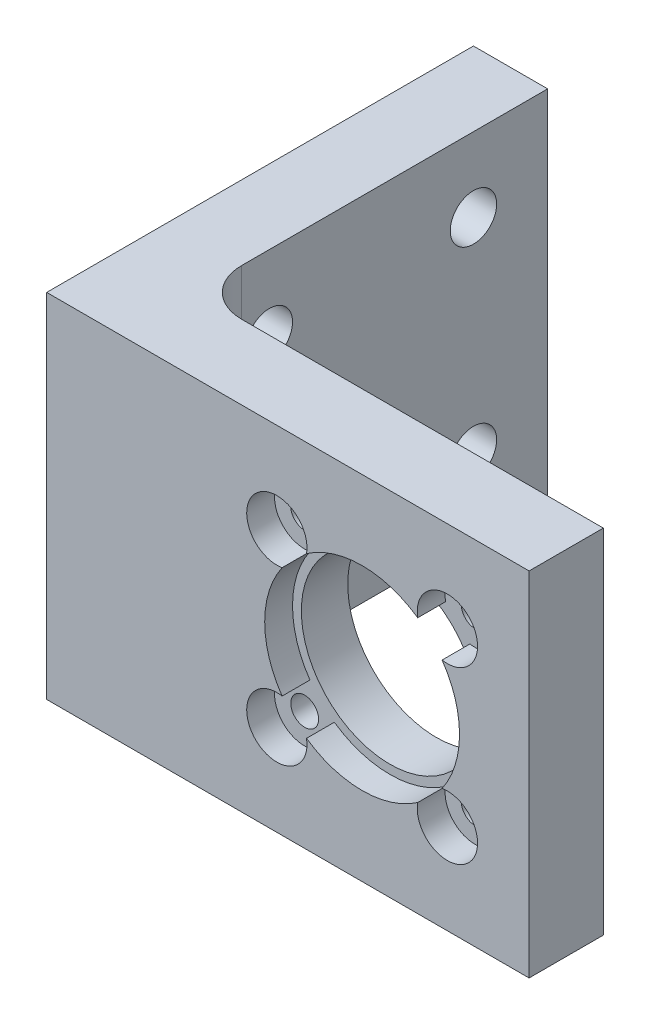
ISO-10303-21;
HEADER;
FILE_DESCRIPTION(('STEP AP214'),'2;1');
FILE_NAME('part.step','',(''),(''),'','','');
FILE_SCHEMA(('AUTOMOTIVE_DESIGN { 1 0 10303 214 1 1 1 1 }'));
ENDSEC;
DATA;
#1=APPLICATION_CONTEXT('core data for automotive mechanical design processes');
#2=APPLICATION_PROTOCOL_DEFINITION('international standard','automotive_design',2000,#1);
#3=PRODUCT_CONTEXT('',#1,'mechanical');
#4=PRODUCT('Part','Part','',(#3));
#5=PRODUCT_RELATED_PRODUCT_CATEGORY('part','',(#4));
#6=PRODUCT_DEFINITION_FORMATION('','',#4);
#7=PRODUCT_DEFINITION_CONTEXT('part definition',#1,'design');
#8=PRODUCT_DEFINITION('design','',#6,#7);
#9=PRODUCT_DEFINITION_SHAPE('','',#8);
#10=(LENGTH_UNIT() NAMED_UNIT(*) SI_UNIT(.MILLI.,.METRE.));
#11=(NAMED_UNIT(*) PLANE_ANGLE_UNIT() SI_UNIT($,.RADIAN.));
#12=(NAMED_UNIT(*) SI_UNIT($,.STERADIAN.) SOLID_ANGLE_UNIT());
#13=UNCERTAINTY_MEASURE_WITH_UNIT(LENGTH_MEASURE(1.E-05),#10,'distance_accuracy_value','');
#14=(GEOMETRIC_REPRESENTATION_CONTEXT(3) GLOBAL_UNCERTAINTY_ASSIGNED_CONTEXT((#13)) GLOBAL_UNIT_ASSIGNED_CONTEXT((#10,
#11,#12)) REPRESENTATION_CONTEXT('',''));
#15=CARTESIAN_POINT('',(0.,0.,0.));
#16=DIRECTION('',(0.,0.,1.));
#17=DIRECTION('',(1.,0.,0.));
#18=AXIS2_PLACEMENT_3D('',#15,#16,#17);
#19=CARTESIAN_POINT('',(0.,0.,5.));
#20=DIRECTION('',(0.,0.,-1.));
#21=DIRECTION('',(-1.,0.,0.));
#22=AXIS2_PLACEMENT_3D('',#19,#20,#21);
#23=PLANE('',#22);
#24=CARTESIAN_POINT('',(24.8076118445749,28.1923881554251,5.));
#25=DIRECTION('',(0.,0.,1.));
#26=DIRECTION('',(-1.,0.,0.));
#27=AXIS2_PLACEMENT_3D('',#24,#25,#26);
#28=CIRCLE('',#27,1.5);
#29=CARTESIAN_POINT('',(23.3076118445749,28.1923881554251,5.));
#30=VERTEX_POINT('',#29);
#31=EDGE_CURVE('E242',#30,#30,#28,.T.);
#32=ORIENTED_EDGE('',*,*,#31,.F.);
#33=EDGE_LOOP('',(#32));
#34=FACE_BOUND('',#33,.T.);
#35=CARTESIAN_POINT('',(24.8076118445749,9.80761184457487,5.));
#36=DIRECTION('',(0.,0.,1.));
#37=DIRECTION('',(1.,0.,0.));
#38=AXIS2_PLACEMENT_3D('',#35,#36,#37);
#39=CIRCLE('',#38,1.5);
#40=CARTESIAN_POINT('',(26.3076118445749,9.80761184457487,5.));
#41=VERTEX_POINT('',#40);
#42=EDGE_CURVE('E248',#41,#41,#39,.T.);
#43=ORIENTED_EDGE('',*,*,#42,.F.);
#44=EDGE_LOOP('',(#43));
#45=FACE_BOUND('',#44,.T.);
#46=CARTESIAN_POINT('',(43.1923881554251,9.80761184457487,5.));
#47=DIRECTION('',(0.,0.,1.));
#48=DIRECTION('',(-1.,0.,0.));
#49=AXIS2_PLACEMENT_3D('',#46,#47,#48);
#50=CIRCLE('',#49,1.5);
#51=CARTESIAN_POINT('',(41.6923881554251,9.80761184457487,5.));
#52=VERTEX_POINT('',#51);
#53=EDGE_CURVE('E254',#52,#52,#50,.T.);
#54=ORIENTED_EDGE('',*,*,#53,.F.);
#55=EDGE_LOOP('',(#54));
#56=FACE_BOUND('',#55,.T.);
#57=CARTESIAN_POINT('',(43.1923881554251,28.1923881554251,5.));
#58=DIRECTION('',(0.,0.,1.));
#59=DIRECTION('',(1.,0.,0.));
#60=AXIS2_PLACEMENT_3D('',#57,#58,#59);
#61=CIRCLE('',#60,1.50000000000001);
#62=CARTESIAN_POINT('',(44.6923881554251,28.1923881554251,5.));
#63=VERTEX_POINT('',#62);
#64=EDGE_CURVE('E260',#63,#63,#61,.T.);
#65=ORIENTED_EDGE('',*,*,#64,.F.);
#66=EDGE_LOOP('',(#65));
#67=FACE_BOUND('',#66,.T.);
#68=CARTESIAN_POINT('',(34.,19.,5.));
#69=DIRECTION('',(0.,0.,1.));
#70=DIRECTION('',(1.,0.,0.));
#71=AXIS2_PLACEMENT_3D('',#68,#69,#70);
#72=CIRCLE('',#71,9.55000000000001);
#73=CARTESIAN_POINT('',(43.55,19.,5.));
#74=VERTEX_POINT('',#73);
#75=EDGE_CURVE('E266',#74,#74,#72,.T.);
#76=ORIENTED_EDGE('',*,*,#75,.F.);
#77=EDGE_LOOP('',(#76));
#78=FACE_BOUND('',#77,.T.);
#79=CARTESIAN_POINT('',(24.8076118445749,9.80761184457488,5.));
#80=DIRECTION('',(0.,0.,1.));
#81=DIRECTION('',(1.,0.,0.));
#82=AXIS2_PLACEMENT_3D('',#79,#80,#81);
#83=CIRCLE('',#82,3.25000000000001);
#84=CARTESIAN_POINT('',(25.3781935279909,13.0071331435429,5.));
#85=VERTEX_POINT('',#84);
#86=CARTESIAN_POINT('',(28.0071331435429,10.3781935279909,5.));
#87=VERTEX_POINT('',#86);
#88=EDGE_CURVE('E151',#85,#87,#83,.T.);
#89=ORIENTED_EDGE('',*,*,#88,.T.);
#90=CARTESIAN_POINT('',(34.,19.,5.));
#91=DIRECTION('',(0.,0.,1.));
#92=DIRECTION('',(1.,0.,0.));
#93=AXIS2_PLACEMENT_3D('',#90,#91,#92);
#94=CIRCLE('',#93,10.5);
#95=CARTESIAN_POINT('',(39.992866856457,10.3781935279909,5.));
#96=VERTEX_POINT('',#95);
#97=EDGE_CURVE('E180',#87,#96,#94,.T.);
#98=ORIENTED_EDGE('',*,*,#97,.T.);
#99=CARTESIAN_POINT('',(43.1923881554251,9.80761184457488,5.));
#100=DIRECTION('',(0.,0.,1.));
#101=DIRECTION('',(-1.,0.,0.));
#102=AXIS2_PLACEMENT_3D('',#99,#100,#101);
#103=CIRCLE('',#102,3.25);
#104=CARTESIAN_POINT('',(42.6218064720091,13.0071331435429,5.));
#105=VERTEX_POINT('',#104);
#106=EDGE_CURVE('E157',#96,#105,#103,.T.);
#107=ORIENTED_EDGE('',*,*,#106,.T.);
#108=CARTESIAN_POINT('',(34.,19.,5.));
#109=DIRECTION('',(0.,0.,1.));
#110=DIRECTION('',(1.,0.,0.));
#111=AXIS2_PLACEMENT_3D('',#108,#109,#110);
#112=CIRCLE('',#111,10.5);
#113=CARTESIAN_POINT('',(42.6218064720091,24.9928668564571,5.));
#114=VERTEX_POINT('',#113);
#115=EDGE_CURVE('E184',#105,#114,#112,.T.);
#116=ORIENTED_EDGE('',*,*,#115,.T.);
#117=CARTESIAN_POINT('',(43.1923881554251,28.1923881554251,5.));
#118=DIRECTION('',(0.,0.,1.));
#119=DIRECTION('',(1.,0.,0.));
#120=AXIS2_PLACEMENT_3D('',#117,#118,#119);
#121=CIRCLE('',#120,3.25);
#122=CARTESIAN_POINT('',(39.992866856457,27.6218064720091,5.));
#123=VERTEX_POINT('',#122);
#124=EDGE_CURVE('E187',#114,#123,#121,.T.);
#125=ORIENTED_EDGE('',*,*,#124,.T.);
#126=CARTESIAN_POINT('',(34.,19.,5.));
#127=DIRECTION('',(0.,0.,1.));
#128=DIRECTION('',(1.,0.,0.));
#129=AXIS2_PLACEMENT_3D('',#126,#127,#128);
#130=CIRCLE('',#129,10.5);
#131=CARTESIAN_POINT('',(28.0071331435429,27.6218064720091,5.));
#132=VERTEX_POINT('',#131);
#133=EDGE_CURVE('E190',#123,#132,#130,.T.);
#134=ORIENTED_EDGE('',*,*,#133,.T.);
#135=CARTESIAN_POINT('',(24.8076118445749,28.1923881554251,5.));
#136=DIRECTION('',(0.,0.,1.));
#137=DIRECTION('',(-1.,0.,0.));
#138=AXIS2_PLACEMENT_3D('',#135,#136,#137);
#139=CIRCLE('',#138,3.25000000000001);
#140=CARTESIAN_POINT('',(25.3781935279909,24.9928668564571,5.));
#141=VERTEX_POINT('',#140);
#142=EDGE_CURVE('E193',#132,#141,#139,.T.);
#143=ORIENTED_EDGE('',*,*,#142,.T.);
#144=CARTESIAN_POINT('',(34.,19.,5.));
#145=DIRECTION('',(0.,0.,1.));
#146=DIRECTION('',(1.,0.,0.));
#147=AXIS2_PLACEMENT_3D('',#144,#145,#146);
#148=CIRCLE('',#147,10.5);
#149=EDGE_CURVE('E196',#141,#85,#148,.T.);
#150=ORIENTED_EDGE('',*,*,#149,.T.);
#151=EDGE_LOOP('',(#89,#98,#107,#116,#125,#134,#143,#150));
#152=FACE_BOUND('',#151,.T.);
#153=ADVANCED_FACE('F35',(#34,#45,#56,#67,#78,#152),#23,.F.);
#154=CARTESIAN_POINT('',(13.,0.,-5.));
#155=DIRECTION('',(0.,1.,0.));
#156=DIRECTION('',(-1.,0.,0.));
#157=AXIS2_PLACEMENT_3D('',#154,#155,#156);
#158=CYLINDRICAL_SURFACE('',#157,5.);
#159=DIRECTION('',(0.,1.,0.));
#160=VECTOR('',#159,1.);
#161=CARTESIAN_POINT('',(13.,0.,0.));
#162=LINE('',#161,#160);
#163=CARTESIAN_POINT('',(13.,0.,0.));
#164=VERTEX_POINT('',#163);
#165=CARTESIAN_POINT('',(13.,38.,0.));
#166=VERTEX_POINT('',#165);
#167=EDGE_CURVE('E287',#164,#166,#162,.T.);
#168=ORIENTED_EDGE('',*,*,#167,.F.);
#169=CARTESIAN_POINT('',(13.,0.,-5.));
#170=DIRECTION('',(0.,1.,0.));
#171=DIRECTION('',(-1.,0.,0.));
#172=AXIS2_PLACEMENT_3D('',#169,#170,#171);
#173=CIRCLE('',#172,5.);
#174=CARTESIAN_POINT('',(7.99999999999999,0.,-5.));
#175=VERTEX_POINT('',#174);
#176=EDGE_CURVE('E43',#164,#175,#173,.F.);
#177=ORIENTED_EDGE('',*,*,#176,.T.);
#178=DIRECTION('',(0.,1.,0.));
#179=VECTOR('',#178,1.);
#180=CARTESIAN_POINT('',(7.99999999999999,0.,-5.));
#181=LINE('',#180,#179);
#182=CARTESIAN_POINT('',(8.,38.,-5.));
#183=VERTEX_POINT('',#182);
#184=EDGE_CURVE('E290',#183,#175,#181,.F.);
#185=ORIENTED_EDGE('',*,*,#184,.F.);
#186=CARTESIAN_POINT('',(13.,38.,-5.));
#187=DIRECTION('',(0.,-1.,0.));
#188=DIRECTION('',(1.,0.,0.));
#189=AXIS2_PLACEMENT_3D('',#186,#187,#188);
#190=CIRCLE('',#189,5.);
#191=EDGE_CURVE('E11',#183,#166,#190,.F.);
#192=ORIENTED_EDGE('',*,*,#191,.T.);
#193=EDGE_LOOP('',(#168,#177,#185,#192));
#194=FACE_BOUND('',#193,.T.);
#195=ADVANCED_FACE('F37',(#194),#158,.F.);
#196=CARTESIAN_POINT('',(0.,0.,0.));
#197=DIRECTION('',(0.,0.,-1.));
#198=DIRECTION('',(-1.,0.,0.));
#199=AXIS2_PLACEMENT_3D('',#196,#197,#198);
#200=PLANE('',#199);
#201=DIRECTION('',(1.,0.,0.));
#202=VECTOR('',#201,1.);
#203=CARTESIAN_POINT('',(0.,0.,0.));
#204=LINE('',#203,#202);
#205=CARTESIAN_POINT('',(52.,0.,0.));
#206=VERTEX_POINT('',#205);
#207=EDGE_CURVE('E269',#164,#206,#204,.T.);
#208=ORIENTED_EDGE('',*,*,#207,.F.);
#209=ORIENTED_EDGE('',*,*,#167,.T.);
#210=DIRECTION('',(-1.,0.,0.));
#211=VECTOR('',#210,1.);
#212=CARTESIAN_POINT('',(0.,38.,0.));
#213=LINE('',#212,#211);
#214=CARTESIAN_POINT('',(52.,38.,0.));
#215=VERTEX_POINT('',#214);
#216=EDGE_CURVE('E275',#215,#166,#213,.T.);
#217=ORIENTED_EDGE('',*,*,#216,.F.);
#218=DIRECTION('',(0.,1.,0.));
#219=VECTOR('',#218,1.);
#220=CARTESIAN_POINT('',(52.,0.,0.));
#221=LINE('',#220,#219);
#222=EDGE_CURVE('E273',#206,#215,#221,.T.);
#223=ORIENTED_EDGE('',*,*,#222,.F.);
#224=EDGE_LOOP('',(#208,#209,#217,#223));
#225=FACE_BOUND('',#224,.T.);
#226=CARTESIAN_POINT('',(24.8076118445749,9.80761184457487,0.));
#227=DIRECTION('',(0.,0.,1.));
#228=DIRECTION('',(1.,0.,0.));
#229=AXIS2_PLACEMENT_3D('',#226,#227,#228);
#230=CIRCLE('',#229,1.5);
#231=CARTESIAN_POINT('',(26.3076118445749,9.80761184457487,0.));
#232=VERTEX_POINT('',#231);
#233=EDGE_CURVE('E245',#232,#232,#230,.T.);
#234=ORIENTED_EDGE('',*,*,#233,.T.);
#235=EDGE_LOOP('',(#234));
#236=FACE_BOUND('',#235,.T.);
#237=CARTESIAN_POINT('',(43.1923881554251,28.1923881554251,0.));
#238=DIRECTION('',(0.,0.,1.));
#239=DIRECTION('',(1.,0.,0.));
#240=AXIS2_PLACEMENT_3D('',#237,#238,#239);
#241=CIRCLE('',#240,1.50000000000001);
#242=CARTESIAN_POINT('',(44.6923881554251,28.1923881554251,0.));
#243=VERTEX_POINT('',#242);
#244=EDGE_CURVE('E257',#243,#243,#241,.T.);
#245=ORIENTED_EDGE('',*,*,#244,.T.);
#246=EDGE_LOOP('',(#245));
#247=FACE_BOUND('',#246,.T.);
#248=CARTESIAN_POINT('',(34.,19.,0.));
#249=DIRECTION('',(0.,0.,1.));
#250=DIRECTION('',(1.,0.,0.));
#251=AXIS2_PLACEMENT_3D('',#248,#249,#250);
#252=CIRCLE('',#251,9.55000000000001);
#253=CARTESIAN_POINT('',(43.55,19.,0.));
#254=VERTEX_POINT('',#253);
#255=EDGE_CURVE('E263',#254,#254,#252,.T.);
#256=ORIENTED_EDGE('',*,*,#255,.T.);
#257=EDGE_LOOP('',(#256));
#258=FACE_BOUND('',#257,.T.);
#259=CARTESIAN_POINT('',(43.1923881554251,9.80761184457487,0.));
#260=DIRECTION('',(0.,0.,1.));
#261=DIRECTION('',(-1.,0.,0.));
#262=AXIS2_PLACEMENT_3D('',#259,#260,#261);
#263=CIRCLE('',#262,1.5);
#264=CARTESIAN_POINT('',(41.6923881554251,9.80761184457487,0.));
#265=VERTEX_POINT('',#264);
#266=EDGE_CURVE('E251',#265,#265,#263,.T.);
#267=ORIENTED_EDGE('',*,*,#266,.T.);
#268=EDGE_LOOP('',(#267));
#269=FACE_BOUND('',#268,.T.);
#270=CARTESIAN_POINT('',(24.8076118445749,28.1923881554251,0.));
#271=DIRECTION('',(0.,0.,1.));
#272=DIRECTION('',(-1.,0.,0.));
#273=AXIS2_PLACEMENT_3D('',#270,#271,#272);
#274=CIRCLE('',#273,1.5);
#275=CARTESIAN_POINT('',(23.3076118445749,28.1923881554251,0.));
#276=VERTEX_POINT('',#275);
#277=EDGE_CURVE('E241',#276,#276,#274,.T.);
#278=ORIENTED_EDGE('',*,*,#277,.T.);
#279=EDGE_LOOP('',(#278));
#280=FACE_BOUND('',#279,.T.);
#281=ADVANCED_FACE('F318',(#225,#236,#247,#258,#269,#280),#200,.T.);
#282=CARTESIAN_POINT('',(0.,0.,5.));
#283=DIRECTION('',(1.,0.,0.));
#284=DIRECTION('',(0.,1.,0.));
#285=AXIS2_PLACEMENT_3D('',#282,#283,#284);
#286=PLANE('',#285);
#287=CARTESIAN_POINT('',(0.,30.,-30.));
#288=DIRECTION('',(-1.,0.,0.));
#289=DIRECTION('',(0.,1.,0.));
#290=AXIS2_PLACEMENT_3D('',#287,#288,#289);
#291=CIRCLE('',#290,2.5);
#292=CARTESIAN_POINT('',(0.,32.5,-30.));
#293=VERTEX_POINT('',#292);
#294=EDGE_CURVE('E370',#293,#293,#291,.T.);
#295=ORIENTED_EDGE('',*,*,#294,.F.);
#296=EDGE_LOOP('',(#295));
#297=FACE_BOUND('',#296,.T.);
#298=CARTESIAN_POINT('',(0.,7.99999999999999,-8.));
#299=DIRECTION('',(-1.,0.,0.));
#300=DIRECTION('',(0.,1.,0.));
#301=AXIS2_PLACEMENT_3D('',#298,#299,#300);
#302=CIRCLE('',#301,2.5);
#303=CARTESIAN_POINT('',(0.,10.5,-8.));
#304=VERTEX_POINT('',#303);
#305=EDGE_CURVE('E374',#304,#304,#302,.T.);
#306=ORIENTED_EDGE('',*,*,#305,.F.);
#307=EDGE_LOOP('',(#306));
#308=FACE_BOUND('',#307,.T.);
#309=CARTESIAN_POINT('',(0.,7.99999999999999,-30.));
#310=DIRECTION('',(-1.,0.,0.));
#311=DIRECTION('',(0.,-1.,0.));
#312=AXIS2_PLACEMENT_3D('',#309,#310,#311);
#313=CIRCLE('',#312,2.5);
#314=CARTESIAN_POINT('',(0.,5.49999999999999,-30.));
#315=VERTEX_POINT('',#314);
#316=EDGE_CURVE('E378',#315,#315,#313,.T.);
#317=ORIENTED_EDGE('',*,*,#316,.F.);
#318=EDGE_LOOP('',(#317));
#319=FACE_BOUND('',#318,.T.);
#320=CARTESIAN_POINT('',(0.,30.,-8.));
#321=DIRECTION('',(-1.,0.,0.));
#322=DIRECTION('',(0.,-1.,0.));
#323=AXIS2_PLACEMENT_3D('',#320,#321,#322);
#324=CIRCLE('',#323,2.5);
#325=CARTESIAN_POINT('',(0.,27.5,-8.));
#326=VERTEX_POINT('',#325);
#327=EDGE_CURVE('E381',#326,#326,#324,.T.);
#328=ORIENTED_EDGE('',*,*,#327,.F.);
#329=EDGE_LOOP('',(#328));
#330=FACE_BOUND('',#329,.T.);
#331=DIRECTION('',(0.,0.,-1.));
#332=VECTOR('',#331,1.);
#333=CARTESIAN_POINT('',(0.,38.,5.));
#334=LINE('',#333,#332);
#335=CARTESIAN_POINT('',(0.,38.,8.));
#336=VERTEX_POINT('',#335);
#337=CARTESIAN_POINT('',(0.,38.,-38.));
#338=VERTEX_POINT('',#337);
#339=EDGE_CURVE('E277',#336,#338,#334,.T.);
#340=ORIENTED_EDGE('',*,*,#339,.T.);
#341=DIRECTION('',(0.,1.,0.));
#342=VECTOR('',#341,1.);
#343=CARTESIAN_POINT('',(0.,0.,-38.));
#344=LINE('',#343,#342);
#345=CARTESIAN_POINT('',(0.,0.,-38.));
#346=VERTEX_POINT('',#345);
#347=EDGE_CURVE('E232',#346,#338,#344,.T.);
#348=ORIENTED_EDGE('',*,*,#347,.F.);
#349=DIRECTION('',(0.,0.,-1.));
#350=VECTOR('',#349,1.);
#351=CARTESIAN_POINT('',(0.,0.,5.));
#352=LINE('',#351,#350);
#353=CARTESIAN_POINT('',(0.,0.,8.));
#354=VERTEX_POINT('',#353);
#355=EDGE_CURVE('E285',#354,#346,#352,.T.);
#356=ORIENTED_EDGE('',*,*,#355,.F.);
#357=DIRECTION('',(0.,-1.,0.));
#358=VECTOR('',#357,1.);
#359=CARTESIAN_POINT('',(0.,38.,8.));
#360=LINE('',#359,#358);
#361=EDGE_CURVE('E158',#336,#354,#360,.T.);
#362=ORIENTED_EDGE('',*,*,#361,.F.);
#363=EDGE_LOOP('',(#340,#348,#356,#362));
#364=FACE_BOUND('',#363,.T.);
#365=ADVANCED_FACE('F307',(#297,#308,#319,#330,#364),#286,.F.);
#366=CARTESIAN_POINT('',(0.,0.,5.));
#367=DIRECTION('',(0.,1.,0.));
#368=DIRECTION('',(-1.,0.,0.));
#369=AXIS2_PLACEMENT_3D('',#366,#367,#368);
#370=PLANE('',#369);
#371=ORIENTED_EDGE('',*,*,#176,.F.);
#372=ORIENTED_EDGE('',*,*,#207,.T.);
#373=DIRECTION('',(0.,0.,-1.));
#374=VECTOR('',#373,1.);
#375=CARTESIAN_POINT('',(52.,0.,5.));
#376=LINE('',#375,#374);
#377=CARTESIAN_POINT('',(52.,0.,8.));
#378=VERTEX_POINT('',#377);
#379=EDGE_CURVE('E282',#378,#206,#376,.T.);
#380=ORIENTED_EDGE('',*,*,#379,.F.);
#381=DIRECTION('',(1.,0.,0.));
#382=VECTOR('',#381,1.);
#383=CARTESIAN_POINT('',(0.,0.,8.));
#384=LINE('',#383,#382);
#385=EDGE_CURVE('E215',#354,#378,#384,.T.);
#386=ORIENTED_EDGE('',*,*,#385,.F.);
#387=ORIENTED_EDGE('',*,*,#355,.T.);
#388=DIRECTION('',(-1.,0.,0.));
#389=VECTOR('',#388,1.);
#390=CARTESIAN_POINT('',(0.,0.,-38.));
#391=LINE('',#390,#389);
#392=CARTESIAN_POINT('',(7.99999999999999,0.,-38.));
#393=VERTEX_POINT('',#392);
#394=EDGE_CURVE('E229',#393,#346,#391,.T.);
#395=ORIENTED_EDGE('',*,*,#394,.F.);
#396=DIRECTION('',(0.,0.,1.));
#397=VECTOR('',#396,1.);
#398=CARTESIAN_POINT('',(7.99999999999999,0.,-38.));
#399=LINE('',#398,#397);
#400=EDGE_CURVE('E235',#393,#175,#399,.T.);
#401=ORIENTED_EDGE('',*,*,#400,.T.);
#402=EDGE_LOOP('',(#371,#372,#380,#386,#387,#395,#401));
#403=FACE_BOUND('',#402,.T.);
#404=ADVANCED_FACE('F300',(#403),#370,.F.);
#405=CARTESIAN_POINT('',(52.,0.,5.));
#406=DIRECTION('',(-1.,0.,0.));
#407=DIRECTION('',(0.,0.,1.));
#408=AXIS2_PLACEMENT_3D('',#405,#406,#407);
#409=PLANE('',#408);
#410=ORIENTED_EDGE('',*,*,#222,.T.);
#411=DIRECTION('',(0.,0.,-1.));
#412=VECTOR('',#411,1.);
#413=CARTESIAN_POINT('',(52.,38.,5.));
#414=LINE('',#413,#412);
#415=CARTESIAN_POINT('',(52.,38.,8.));
#416=VERTEX_POINT('',#415);
#417=EDGE_CURVE('E279',#416,#215,#414,.T.);
#418=ORIENTED_EDGE('',*,*,#417,.F.);
#419=DIRECTION('',(0.,1.,0.));
#420=VECTOR('',#419,1.);
#421=CARTESIAN_POINT('',(52.,38.,8.));
#422=LINE('',#421,#420);
#423=EDGE_CURVE('E218',#378,#416,#422,.T.);
#424=ORIENTED_EDGE('',*,*,#423,.F.);
#425=ORIENTED_EDGE('',*,*,#379,.T.);
#426=EDGE_LOOP('',(#410,#418,#424,#425));
#427=FACE_BOUND('',#426,.T.);
#428=ADVANCED_FACE('F314',(#427),#409,.F.);
#429=CARTESIAN_POINT('',(0.,38.,5.));
#430=DIRECTION('',(0.,-1.,0.));
#431=DIRECTION('',(1.,0.,0.));
#432=AXIS2_PLACEMENT_3D('',#429,#430,#431);
#433=PLANE('',#432);
#434=ORIENTED_EDGE('',*,*,#216,.T.);
#435=ORIENTED_EDGE('',*,*,#191,.F.);
#436=DIRECTION('',(0.,0.,1.));
#437=VECTOR('',#436,1.);
#438=CARTESIAN_POINT('',(8.,38.,-38.));
#439=LINE('',#438,#437);
#440=CARTESIAN_POINT('',(8.,38.,-38.));
#441=VERTEX_POINT('',#440);
#442=EDGE_CURVE('E238',#441,#183,#439,.T.);
#443=ORIENTED_EDGE('',*,*,#442,.F.);
#444=DIRECTION('',(1.,0.,0.));
#445=VECTOR('',#444,1.);
#446=CARTESIAN_POINT('',(0.,38.,-38.));
#447=LINE('',#446,#445);
#448=EDGE_CURVE('E224',#338,#441,#447,.T.);
#449=ORIENTED_EDGE('',*,*,#448,.F.);
#450=ORIENTED_EDGE('',*,*,#339,.F.);
#451=DIRECTION('',(-1.,0.,0.));
#452=VECTOR('',#451,1.);
#453=CARTESIAN_POINT('',(0.,38.,8.));
#454=LINE('',#453,#452);
#455=EDGE_CURVE('E221',#416,#336,#454,.T.);
#456=ORIENTED_EDGE('',*,*,#455,.F.);
#457=ORIENTED_EDGE('',*,*,#417,.T.);
#458=EDGE_LOOP('',(#434,#435,#443,#449,#450,#456,#457));
#459=FACE_BOUND('',#458,.T.);
#460=ADVANCED_FACE('F310',(#459),#433,.F.);
#461=CARTESIAN_POINT('',(34.,19.,5.));
#462=DIRECTION('',(0.,0.,-1.));
#463=DIRECTION('',(-1.,0.,0.));
#464=AXIS2_PLACEMENT_3D('',#461,#462,#463);
#465=CYLINDRICAL_SURFACE('',#464,9.55000000000001);
#466=ORIENTED_EDGE('',*,*,#75,.T.);
#467=EDGE_LOOP('',(#466));
#468=FACE_BOUND('',#467,.T.);
#469=ORIENTED_EDGE('',*,*,#255,.F.);
#470=EDGE_LOOP('',(#469));
#471=FACE_BOUND('',#470,.T.);
#472=ADVANCED_FACE('F355',(#468,#471),#465,.F.);
#473=CARTESIAN_POINT('',(43.1923881554251,28.1923881554251,5.));
#474=DIRECTION('',(0.,0.,-1.));
#475=DIRECTION('',(-1.,0.,0.));
#476=AXIS2_PLACEMENT_3D('',#473,#474,#475);
#477=CYLINDRICAL_SURFACE('',#476,1.50000000000001);
#478=ORIENTED_EDGE('',*,*,#64,.T.);
#479=EDGE_LOOP('',(#478));
#480=FACE_BOUND('',#479,.T.);
#481=ORIENTED_EDGE('',*,*,#244,.F.);
#482=EDGE_LOOP('',(#481));
#483=FACE_BOUND('',#482,.T.);
#484=ADVANCED_FACE('F585',(#480,#483),#477,.F.);
#485=CARTESIAN_POINT('',(43.1923881554251,9.80761184457487,5.));
#486=DIRECTION('',(0.,0.,-1.));
#487=DIRECTION('',(-1.,0.,0.));
#488=AXIS2_PLACEMENT_3D('',#485,#486,#487);
#489=CYLINDRICAL_SURFACE('',#488,1.5);
#490=ORIENTED_EDGE('',*,*,#53,.T.);
#491=EDGE_LOOP('',(#490));
#492=FACE_BOUND('',#491,.T.);
#493=ORIENTED_EDGE('',*,*,#266,.F.);
#494=EDGE_LOOP('',(#493));
#495=FACE_BOUND('',#494,.T.);
#496=ADVANCED_FACE('F343',(#492,#495),#489,.F.);
#497=CARTESIAN_POINT('',(24.8076118445749,9.80761184457487,5.));
#498=DIRECTION('',(0.,0.,-1.));
#499=DIRECTION('',(-1.,0.,0.));
#500=AXIS2_PLACEMENT_3D('',#497,#498,#499);
#501=CYLINDRICAL_SURFACE('',#500,1.5);
#502=ORIENTED_EDGE('',*,*,#42,.T.);
#503=EDGE_LOOP('',(#502));
#504=FACE_BOUND('',#503,.T.);
#505=ORIENTED_EDGE('',*,*,#233,.F.);
#506=EDGE_LOOP('',(#505));
#507=FACE_BOUND('',#506,.T.);
#508=ADVANCED_FACE('F334',(#504,#507),#501,.F.);
#509=CARTESIAN_POINT('',(24.8076118445749,28.1923881554251,5.));
#510=DIRECTION('',(0.,0.,-1.));
#511=DIRECTION('',(-1.,0.,0.));
#512=AXIS2_PLACEMENT_3D('',#509,#510,#511);
#513=CYLINDRICAL_SURFACE('',#512,1.5);
#514=ORIENTED_EDGE('',*,*,#31,.T.);
#515=EDGE_LOOP('',(#514));
#516=FACE_BOUND('',#515,.T.);
#517=ORIENTED_EDGE('',*,*,#277,.F.);
#518=EDGE_LOOP('',(#517));
#519=FACE_BOUND('',#518,.T.);
#520=ADVANCED_FACE('F332',(#516,#519),#513,.F.);
#521=CARTESIAN_POINT('',(7.99999999999999,0.,-38.));
#522=DIRECTION('',(-1.,0.,0.));
#523=DIRECTION('',(0.,-1.,0.));
#524=AXIS2_PLACEMENT_3D('',#521,#522,#523);
#525=PLANE('',#524);
#526=CARTESIAN_POINT('',(7.99999999999999,30.,-30.));
#527=DIRECTION('',(-1.,0.,0.));
#528=DIRECTION('',(0.,1.,0.));
#529=AXIS2_PLACEMENT_3D('',#526,#527,#528);
#530=CIRCLE('',#529,2.5);
#531=CARTESIAN_POINT('',(7.99999999999999,32.5,-30.));
#532=VERTEX_POINT('',#531);
#533=EDGE_CURVE('E383',#532,#532,#530,.T.);
#534=ORIENTED_EDGE('',*,*,#533,.T.);
#535=EDGE_LOOP('',(#534));
#536=FACE_BOUND('',#535,.T.);
#537=CARTESIAN_POINT('',(8.,7.99999999999999,-8.));
#538=DIRECTION('',(-1.,0.,0.));
#539=DIRECTION('',(0.,1.,0.));
#540=AXIS2_PLACEMENT_3D('',#537,#538,#539);
#541=CIRCLE('',#540,2.5);
#542=CARTESIAN_POINT('',(8.,10.5,-8.));
#543=VERTEX_POINT('',#542);
#544=EDGE_CURVE('E390',#543,#543,#541,.T.);
#545=ORIENTED_EDGE('',*,*,#544,.T.);
#546=EDGE_LOOP('',(#545));
#547=FACE_BOUND('',#546,.T.);
#548=CARTESIAN_POINT('',(8.,7.99999999999999,-30.));
#549=DIRECTION('',(-1.,0.,0.));
#550=DIRECTION('',(0.,-1.,0.));
#551=AXIS2_PLACEMENT_3D('',#548,#549,#550);
#552=CIRCLE('',#551,2.5);
#553=CARTESIAN_POINT('',(8.,5.49999999999999,-30.));
#554=VERTEX_POINT('',#553);
#555=EDGE_CURVE('E391',#554,#554,#552,.T.);
#556=ORIENTED_EDGE('',*,*,#555,.T.);
#557=EDGE_LOOP('',(#556));
#558=FACE_BOUND('',#557,.T.);
#559=CARTESIAN_POINT('',(7.99999999999999,30.,-8.));
#560=DIRECTION('',(-1.,0.,0.));
#561=DIRECTION('',(0.,-1.,0.));
#562=AXIS2_PLACEMENT_3D('',#559,#560,#561);
#563=CIRCLE('',#562,2.5);
#564=CARTESIAN_POINT('',(7.99999999999999,27.5,-8.));
#565=VERTEX_POINT('',#564);
#566=EDGE_CURVE('E182',#565,#565,#563,.T.);
#567=ORIENTED_EDGE('',*,*,#566,.T.);
#568=EDGE_LOOP('',(#567));
#569=FACE_BOUND('',#568,.T.);
#570=ORIENTED_EDGE('',*,*,#442,.T.);
#571=ORIENTED_EDGE('',*,*,#184,.T.);
#572=ORIENTED_EDGE('',*,*,#400,.F.);
#573=DIRECTION('',(0.,-1.,0.));
#574=VECTOR('',#573,1.);
#575=CARTESIAN_POINT('',(7.99999999999999,0.,-38.));
#576=LINE('',#575,#574);
#577=EDGE_CURVE('E227',#441,#393,#576,.T.);
#578=ORIENTED_EDGE('',*,*,#577,.F.);
#579=EDGE_LOOP('',(#570,#571,#572,#578));
#580=FACE_BOUND('',#579,.T.);
#581=ADVANCED_FACE('F298',(#536,#547,#558,#569,#580),#525,.F.);
#582=CARTESIAN_POINT('',(0.,0.,-38.));
#583=DIRECTION('',(0.,0.,-1.));
#584=DIRECTION('',(-1.,0.,0.));
#585=AXIS2_PLACEMENT_3D('',#582,#583,#584);
#586=PLANE('',#585);
#587=ORIENTED_EDGE('',*,*,#448,.T.);
#588=ORIENTED_EDGE('',*,*,#577,.T.);
#589=ORIENTED_EDGE('',*,*,#394,.T.);
#590=ORIENTED_EDGE('',*,*,#347,.T.);
#591=EDGE_LOOP('',(#587,#588,#589,#590));
#592=FACE_BOUND('',#591,.T.);
#593=ADVANCED_FACE('F304',(#592),#586,.T.);
#594=CARTESIAN_POINT('',(0.,0.,8.));
#595=DIRECTION('',(0.,0.,1.));
#596=DIRECTION('',(1.,0.,0.));
#597=AXIS2_PLACEMENT_3D('',#594,#595,#596);
#598=PLANE('',#597);
#599=ORIENTED_EDGE('',*,*,#361,.T.);
#600=ORIENTED_EDGE('',*,*,#385,.T.);
#601=ORIENTED_EDGE('',*,*,#423,.T.);
#602=ORIENTED_EDGE('',*,*,#455,.T.);
#603=EDGE_LOOP('',(#599,#600,#601,#602));
#604=FACE_BOUND('',#603,.T.);
#605=CARTESIAN_POINT('',(43.1923881554251,9.80761184457488,8.));
#606=DIRECTION('',(0.,0.,1.));
#607=DIRECTION('',(-1.,0.,0.));
#608=AXIS2_PLACEMENT_3D('',#605,#606,#607);
#609=CIRCLE('',#608,3.25);
#610=CARTESIAN_POINT('',(39.992866856457,10.3781935279909,8.));
#611=VERTEX_POINT('',#610);
#612=CARTESIAN_POINT('',(42.6218064720091,13.0071331435429,8.));
#613=VERTEX_POINT('',#612);
#614=EDGE_CURVE('E150',#611,#613,#609,.T.);
#615=ORIENTED_EDGE('',*,*,#614,.F.);
#616=CARTESIAN_POINT('',(34.,19.,8.));
#617=DIRECTION('',(0.,0.,1.));
#618=DIRECTION('',(1.,0.,0.));
#619=AXIS2_PLACEMENT_3D('',#616,#617,#618);
#620=CIRCLE('',#619,10.5);
#621=CARTESIAN_POINT('',(28.0071331435429,10.3781935279909,8.));
#622=VERTEX_POINT('',#621);
#623=EDGE_CURVE('E142',#622,#611,#620,.T.);
#624=ORIENTED_EDGE('',*,*,#623,.F.);
#625=CARTESIAN_POINT('',(24.8076118445749,9.80761184457488,8.));
#626=DIRECTION('',(0.,0.,1.));
#627=DIRECTION('',(1.,0.,0.));
#628=AXIS2_PLACEMENT_3D('',#625,#626,#627);
#629=CIRCLE('',#628,3.25000000000001);
#630=CARTESIAN_POINT('',(25.3781935279909,13.0071331435429,8.));
#631=VERTEX_POINT('',#630);
#632=EDGE_CURVE('E178',#631,#622,#629,.T.);
#633=ORIENTED_EDGE('',*,*,#632,.F.);
#634=CARTESIAN_POINT('',(34.,19.,8.));
#635=DIRECTION('',(0.,0.,1.));
#636=DIRECTION('',(1.,0.,0.));
#637=AXIS2_PLACEMENT_3D('',#634,#635,#636);
#638=CIRCLE('',#637,10.5);
#639=CARTESIAN_POINT('',(25.3781935279909,24.9928668564571,8.));
#640=VERTEX_POINT('',#639);
#641=EDGE_CURVE('E175',#640,#631,#638,.T.);
#642=ORIENTED_EDGE('',*,*,#641,.F.);
#643=CARTESIAN_POINT('',(24.8076118445749,28.1923881554251,8.));
#644=DIRECTION('',(0.,0.,1.));
#645=DIRECTION('',(-1.,0.,0.));
#646=AXIS2_PLACEMENT_3D('',#643,#644,#645);
#647=CIRCLE('',#646,3.25000000000001);
#648=CARTESIAN_POINT('',(28.0071331435429,27.6218064720091,8.));
#649=VERTEX_POINT('',#648);
#650=EDGE_CURVE('E173',#649,#640,#647,.T.);
#651=ORIENTED_EDGE('',*,*,#650,.F.);
#652=CARTESIAN_POINT('',(34.,19.,8.));
#653=DIRECTION('',(0.,0.,1.));
#654=DIRECTION('',(1.,0.,0.));
#655=AXIS2_PLACEMENT_3D('',#652,#653,#654);
#656=CIRCLE('',#655,10.5);
#657=CARTESIAN_POINT('',(39.992866856457,27.6218064720091,8.));
#658=VERTEX_POINT('',#657);
#659=EDGE_CURVE('E171',#658,#649,#656,.T.);
#660=ORIENTED_EDGE('',*,*,#659,.F.);
#661=CARTESIAN_POINT('',(43.1923881554251,28.1923881554251,8.));
#662=DIRECTION('',(0.,0.,1.));
#663=DIRECTION('',(1.,0.,0.));
#664=AXIS2_PLACEMENT_3D('',#661,#662,#663);
#665=CIRCLE('',#664,3.25);
#666=CARTESIAN_POINT('',(42.6218064720091,24.9928668564571,8.));
#667=VERTEX_POINT('',#666);
#668=EDGE_CURVE('E166',#667,#658,#665,.T.);
#669=ORIENTED_EDGE('',*,*,#668,.F.);
#670=CARTESIAN_POINT('',(34.,19.,8.));
#671=DIRECTION('',(0.,0.,1.));
#672=DIRECTION('',(1.,0.,0.));
#673=AXIS2_PLACEMENT_3D('',#670,#671,#672);
#674=CIRCLE('',#673,10.5);
#675=EDGE_CURVE('E164',#613,#667,#674,.T.);
#676=ORIENTED_EDGE('',*,*,#675,.F.);
#677=EDGE_LOOP('',(#615,#624,#633,#642,#651,#660,#669,#676));
#678=FACE_BOUND('',#677,.T.);
#679=ADVANCED_FACE('F162',(#604,#678),#598,.T.);
#680=CARTESIAN_POINT('',(34.,19.,8.));
#681=DIRECTION('',(0.,0.,-1.));
#682=DIRECTION('',(-1.,0.,0.));
#683=AXIS2_PLACEMENT_3D('',#680,#681,#682);
#684=CYLINDRICAL_SURFACE('',#683,10.5);
#685=ORIENTED_EDGE('',*,*,#97,.F.);
#686=DIRECTION('',(0.,0.,-1.));
#687=VECTOR('',#686,1.);
#688=CARTESIAN_POINT('',(28.0071331435429,10.3781935279909,8.));
#689=LINE('',#688,#687);
#690=EDGE_CURVE('E50',#622,#87,#689,.T.);
#691=ORIENTED_EDGE('',*,*,#690,.F.);
#692=ORIENTED_EDGE('',*,*,#623,.T.);
#693=DIRECTION('',(0.,0.,-1.));
#694=VECTOR('',#693,1.);
#695=CARTESIAN_POINT('',(39.992866856457,10.3781935279909,8.));
#696=LINE('',#695,#694);
#697=EDGE_CURVE('E145',#611,#96,#696,.T.);
#698=ORIENTED_EDGE('',*,*,#697,.T.);
#699=EDGE_LOOP('',(#685,#691,#692,#698));
#700=FACE_BOUND('',#699,.T.);
#701=ADVANCED_FACE('F144',(#700),#684,.F.);
#702=CARTESIAN_POINT('',(43.1923881554251,9.80761184457488,8.));
#703=DIRECTION('',(0.,0.,-1.));
#704=DIRECTION('',(-1.,0.,0.));
#705=AXIS2_PLACEMENT_3D('',#702,#703,#704);
#706=CYLINDRICAL_SURFACE('',#705,3.25);
#707=ORIENTED_EDGE('',*,*,#106,.F.);
#708=ORIENTED_EDGE('',*,*,#697,.F.);
#709=ORIENTED_EDGE('',*,*,#614,.T.);
#710=DIRECTION('',(0.,0.,-1.));
#711=VECTOR('',#710,1.);
#712=CARTESIAN_POINT('',(42.6218064720091,13.0071331435429,8.));
#713=LINE('',#712,#711);
#714=EDGE_CURVE('E159',#613,#105,#713,.T.);
#715=ORIENTED_EDGE('',*,*,#714,.T.);
#716=EDGE_LOOP('',(#707,#708,#709,#715));
#717=FACE_BOUND('',#716,.T.);
#718=ADVANCED_FACE('F154',(#717),#706,.F.);
#719=CARTESIAN_POINT('',(34.,19.,8.));
#720=DIRECTION('',(0.,0.,-1.));
#721=DIRECTION('',(-1.,0.,0.));
#722=AXIS2_PLACEMENT_3D('',#719,#720,#721);
#723=CYLINDRICAL_SURFACE('',#722,10.5);
#724=ORIENTED_EDGE('',*,*,#115,.F.);
#725=ORIENTED_EDGE('',*,*,#714,.F.);
#726=ORIENTED_EDGE('',*,*,#675,.T.);
#727=DIRECTION('',(0.,0.,-1.));
#728=VECTOR('',#727,1.);
#729=CARTESIAN_POINT('',(42.6218064720091,24.9928668564571,8.));
#730=LINE('',#729,#728);
#731=EDGE_CURVE('E210',#667,#114,#730,.T.);
#732=ORIENTED_EDGE('',*,*,#731,.T.);
#733=EDGE_LOOP('',(#724,#725,#726,#732));
#734=FACE_BOUND('',#733,.T.);
#735=ADVANCED_FACE('F438',(#734),#723,.F.);
#736=CARTESIAN_POINT('',(43.1923881554251,28.1923881554251,8.));
#737=DIRECTION('',(0.,0.,-1.));
#738=DIRECTION('',(-1.,0.,0.));
#739=AXIS2_PLACEMENT_3D('',#736,#737,#738);
#740=CYLINDRICAL_SURFACE('',#739,3.25);
#741=ORIENTED_EDGE('',*,*,#124,.F.);
#742=ORIENTED_EDGE('',*,*,#731,.F.);
#743=ORIENTED_EDGE('',*,*,#668,.T.);
#744=DIRECTION('',(0.,0.,-1.));
#745=VECTOR('',#744,1.);
#746=CARTESIAN_POINT('',(39.992866856457,27.6218064720091,8.));
#747=LINE('',#746,#745);
#748=EDGE_CURVE('E208',#658,#123,#747,.T.);
#749=ORIENTED_EDGE('',*,*,#748,.T.);
#750=EDGE_LOOP('',(#741,#742,#743,#749));
#751=FACE_BOUND('',#750,.T.);
#752=ADVANCED_FACE('F434',(#751),#740,.F.);
#753=CARTESIAN_POINT('',(34.,19.,8.));
#754=DIRECTION('',(0.,0.,-1.));
#755=DIRECTION('',(-1.,0.,0.));
#756=AXIS2_PLACEMENT_3D('',#753,#754,#755);
#757=CYLINDRICAL_SURFACE('',#756,10.5);
#758=ORIENTED_EDGE('',*,*,#133,.F.);
#759=ORIENTED_EDGE('',*,*,#748,.F.);
#760=ORIENTED_EDGE('',*,*,#659,.T.);
#761=DIRECTION('',(0.,0.,-1.));
#762=VECTOR('',#761,1.);
#763=CARTESIAN_POINT('',(28.0071331435429,27.6218064720091,8.));
#764=LINE('',#763,#762);
#765=EDGE_CURVE('E206',#649,#132,#764,.T.);
#766=ORIENTED_EDGE('',*,*,#765,.T.);
#767=EDGE_LOOP('',(#758,#759,#760,#766));
#768=FACE_BOUND('',#767,.T.);
#769=ADVANCED_FACE('F430',(#768),#757,.F.);
#770=CARTESIAN_POINT('',(24.8076118445749,28.1923881554251,8.));
#771=DIRECTION('',(0.,0.,-1.));
#772=DIRECTION('',(-1.,0.,0.));
#773=AXIS2_PLACEMENT_3D('',#770,#771,#772);
#774=CYLINDRICAL_SURFACE('',#773,3.25000000000001);
#775=ORIENTED_EDGE('',*,*,#142,.F.);
#776=ORIENTED_EDGE('',*,*,#765,.F.);
#777=ORIENTED_EDGE('',*,*,#650,.T.);
#778=DIRECTION('',(0.,0.,-1.));
#779=VECTOR('',#778,1.);
#780=CARTESIAN_POINT('',(25.3781935279909,24.9928668564571,8.));
#781=LINE('',#780,#779);
#782=EDGE_CURVE('E204',#640,#141,#781,.T.);
#783=ORIENTED_EDGE('',*,*,#782,.T.);
#784=EDGE_LOOP('',(#775,#776,#777,#783));
#785=FACE_BOUND('',#784,.T.);
#786=ADVANCED_FACE('F426',(#785),#774,.F.);
#787=CARTESIAN_POINT('',(34.,19.,8.));
#788=DIRECTION('',(0.,0.,-1.));
#789=DIRECTION('',(-1.,0.,0.));
#790=AXIS2_PLACEMENT_3D('',#787,#788,#789);
#791=CYLINDRICAL_SURFACE('',#790,10.5);
#792=ORIENTED_EDGE('',*,*,#149,.F.);
#793=ORIENTED_EDGE('',*,*,#782,.F.);
#794=ORIENTED_EDGE('',*,*,#641,.T.);
#795=DIRECTION('',(0.,0.,-1.));
#796=VECTOR('',#795,1.);
#797=CARTESIAN_POINT('',(25.3781935279909,13.0071331435429,8.));
#798=LINE('',#797,#796);
#799=EDGE_CURVE('E202',#631,#85,#798,.T.);
#800=ORIENTED_EDGE('',*,*,#799,.T.);
#801=EDGE_LOOP('',(#792,#793,#794,#800));
#802=FACE_BOUND('',#801,.T.);
#803=ADVANCED_FACE('F423',(#802),#791,.F.);
#804=CARTESIAN_POINT('',(24.8076118445749,9.80761184457488,8.));
#805=DIRECTION('',(0.,0.,-1.));
#806=DIRECTION('',(-1.,0.,0.));
#807=AXIS2_PLACEMENT_3D('',#804,#805,#806);
#808=CYLINDRICAL_SURFACE('',#807,3.25000000000001);
#809=ORIENTED_EDGE('',*,*,#88,.F.);
#810=ORIENTED_EDGE('',*,*,#799,.F.);
#811=ORIENTED_EDGE('',*,*,#632,.T.);
#812=ORIENTED_EDGE('',*,*,#690,.T.);
#813=EDGE_LOOP('',(#809,#810,#811,#812));
#814=FACE_BOUND('',#813,.T.);
#815=ADVANCED_FACE('F414',(#814),#808,.F.);
#816=CARTESIAN_POINT('',(7.99999999999999,30.,-8.));
#817=DIRECTION('',(-1.,0.,0.));
#818=DIRECTION('',(0.,-1.,0.));
#819=AXIS2_PLACEMENT_3D('',#816,#817,#818);
#820=CYLINDRICAL_SURFACE('',#819,2.5);
#821=ORIENTED_EDGE('',*,*,#566,.F.);
#822=EDGE_LOOP('',(#821));
#823=FACE_BOUND('',#822,.T.);
#824=ORIENTED_EDGE('',*,*,#327,.T.);
#825=EDGE_LOOP('',(#824));
#826=FACE_BOUND('',#825,.T.);
#827=ADVANCED_FACE('F405',(#823,#826),#820,.F.);
#828=CARTESIAN_POINT('',(8.,7.99999999999999,-30.));
#829=DIRECTION('',(-1.,0.,0.));
#830=DIRECTION('',(0.,-1.,0.));
#831=AXIS2_PLACEMENT_3D('',#828,#829,#830);
#832=CYLINDRICAL_SURFACE('',#831,2.5);
#833=ORIENTED_EDGE('',*,*,#555,.F.);
#834=EDGE_LOOP('',(#833));
#835=FACE_BOUND('',#834,.T.);
#836=ORIENTED_EDGE('',*,*,#316,.T.);
#837=EDGE_LOOP('',(#836));
#838=FACE_BOUND('',#837,.T.);
#839=ADVANCED_FACE('F401',(#835,#838),#832,.F.);
#840=CARTESIAN_POINT('',(8.,7.99999999999999,-8.));
#841=DIRECTION('',(-1.,0.,0.));
#842=DIRECTION('',(0.,-1.,0.));
#843=AXIS2_PLACEMENT_3D('',#840,#841,#842);
#844=CYLINDRICAL_SURFACE('',#843,2.5);
#845=ORIENTED_EDGE('',*,*,#544,.F.);
#846=EDGE_LOOP('',(#845));
#847=FACE_BOUND('',#846,.T.);
#848=ORIENTED_EDGE('',*,*,#305,.T.);
#849=EDGE_LOOP('',(#848));
#850=FACE_BOUND('',#849,.T.);
#851=ADVANCED_FACE('F404',(#847,#850),#844,.F.);
#852=CARTESIAN_POINT('',(7.99999999999999,30.,-30.));
#853=DIRECTION('',(-1.,0.,0.));
#854=DIRECTION('',(0.,-1.,0.));
#855=AXIS2_PLACEMENT_3D('',#852,#853,#854);
#856=CYLINDRICAL_SURFACE('',#855,2.5);
#857=ORIENTED_EDGE('',*,*,#533,.F.);
#858=EDGE_LOOP('',(#857));
#859=FACE_BOUND('',#858,.T.);
#860=ORIENTED_EDGE('',*,*,#294,.T.);
#861=EDGE_LOOP('',(#860));
#862=FACE_BOUND('',#861,.T.);
#863=ADVANCED_FACE('F411',(#859,#862),#856,.F.);
#864=CLOSED_SHELL('',(#153,#195,#281,#365,#404,#428,#460,#472,#484,#496,#508,#520,#581,#593,
#679,#701,#718,#735,#752,#769,#786,#803,#815,#827,#839,#851,#863));
#865=MANIFOLD_SOLID_BREP('B2',#864);
#866=ADVANCED_BREP_SHAPE_REPRESENTATION('',(#18,#865),#14);
#867=SHAPE_DEFINITION_REPRESENTATION(#9,#866);
ENDSEC;
END-ISO-10303-21;
